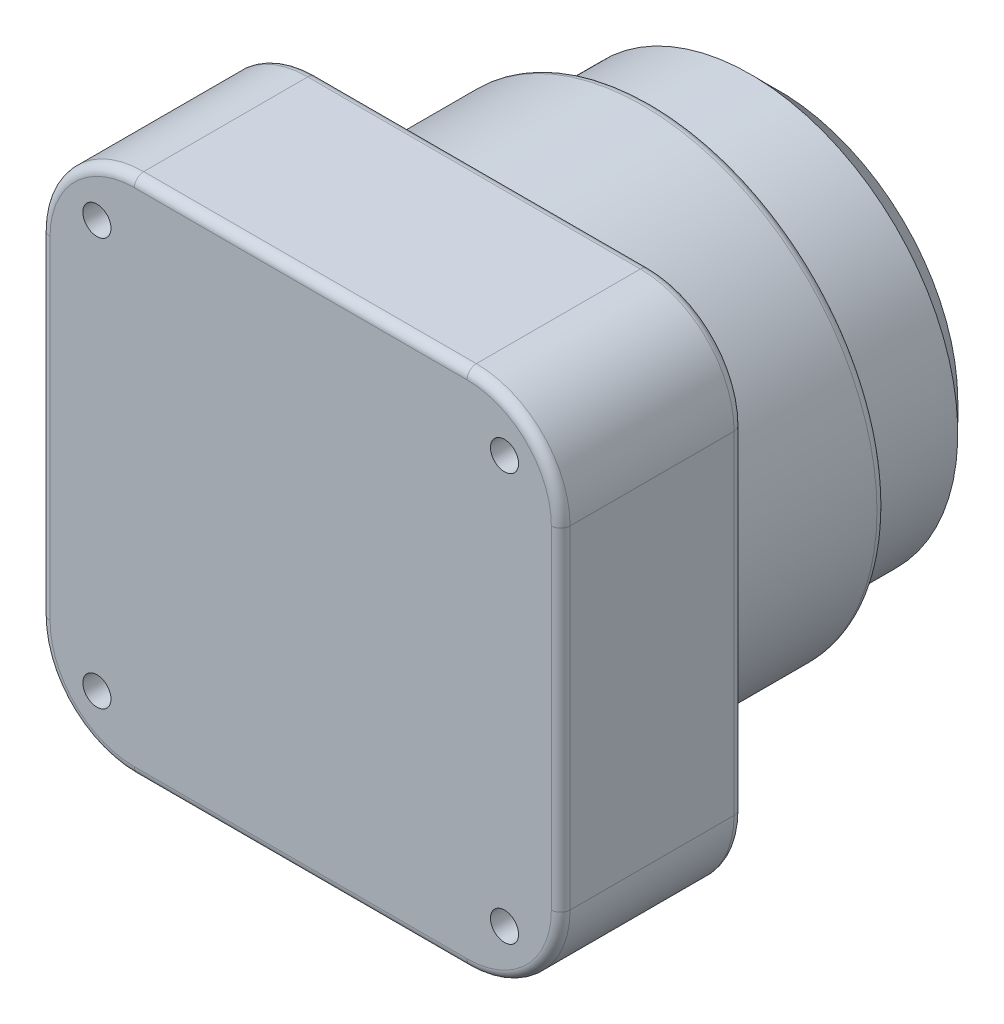
ISO-10303-21;
HEADER;
FILE_DESCRIPTION(('STEP AP214'),'2;1');
FILE_NAME('part.step','',(''),(''),'','','');
FILE_SCHEMA(('AUTOMOTIVE_DESIGN { 1 0 10303 214 1 1 1 1 }'));
ENDSEC;
DATA;
#1=APPLICATION_CONTEXT('core data for automotive mechanical design processes');
#2=APPLICATION_PROTOCOL_DEFINITION('international standard','automotive_design',2000,#1);
#3=PRODUCT_CONTEXT('',#1,'mechanical');
#4=PRODUCT('Part','Part','',(#3));
#5=PRODUCT_RELATED_PRODUCT_CATEGORY('part','',(#4));
#6=PRODUCT_DEFINITION_FORMATION('','',#4);
#7=PRODUCT_DEFINITION_CONTEXT('part definition',#1,'design');
#8=PRODUCT_DEFINITION('design','',#6,#7);
#9=PRODUCT_DEFINITION_SHAPE('','',#8);
#10=(LENGTH_UNIT() NAMED_UNIT(*) SI_UNIT(.MILLI.,.METRE.));
#11=(NAMED_UNIT(*) PLANE_ANGLE_UNIT() SI_UNIT($,.RADIAN.));
#12=(NAMED_UNIT(*) SI_UNIT($,.STERADIAN.) SOLID_ANGLE_UNIT());
#13=UNCERTAINTY_MEASURE_WITH_UNIT(LENGTH_MEASURE(1.E-05),#10,'distance_accuracy_value','');
#14=(GEOMETRIC_REPRESENTATION_CONTEXT(3) GLOBAL_UNCERTAINTY_ASSIGNED_CONTEXT((#13)) GLOBAL_UNIT_ASSIGNED_CONTEXT((#10,
#11,#12)) REPRESENTATION_CONTEXT('',''));
#15=CARTESIAN_POINT('',(0.,0.,0.));
#16=DIRECTION('',(0.,0.,1.));
#17=DIRECTION('',(1.,0.,0.));
#18=AXIS2_PLACEMENT_3D('',#15,#16,#17);
#19=CARTESIAN_POINT('',(0.,0.,19.5));
#20=DIRECTION('',(0.,0.,1.));
#21=DIRECTION('',(1.,0.,0.));
#22=AXIS2_PLACEMENT_3D('',#19,#20,#21);
#23=PLANE('',#22);
#24=CARTESIAN_POINT('',(-21.75,-21.75,19.5));
#25=DIRECTION('',(0.,0.,1.));
#26=DIRECTION('',(1.,0.,0.));
#27=AXIS2_PLACEMENT_3D('',#24,#25,#26);
#28=CIRCLE('',#27,1.5);
#29=CARTESIAN_POINT('',(-20.25,-21.75,19.5));
#30=VERTEX_POINT('',#29);
#31=EDGE_CURVE('E233',#30,#30,#28,.T.);
#32=ORIENTED_EDGE('',*,*,#31,.F.);
#33=EDGE_LOOP('',(#32));
#34=FACE_BOUND('',#33,.T.);
#35=CARTESIAN_POINT('',(21.75,-21.75,19.5));
#36=DIRECTION('',(0.,0.,1.));
#37=DIRECTION('',(1.,0.,0.));
#38=AXIS2_PLACEMENT_3D('',#35,#36,#37);
#39=CIRCLE('',#38,1.5);
#40=CARTESIAN_POINT('',(23.25,-21.75,19.5));
#41=VERTEX_POINT('',#40);
#42=EDGE_CURVE('E227',#41,#41,#39,.T.);
#43=ORIENTED_EDGE('',*,*,#42,.F.);
#44=EDGE_LOOP('',(#43));
#45=FACE_BOUND('',#44,.T.);
#46=CARTESIAN_POINT('',(21.75,21.75,19.5));
#47=DIRECTION('',(0.,0.,1.));
#48=DIRECTION('',(1.,0.,0.));
#49=AXIS2_PLACEMENT_3D('',#46,#47,#48);
#50=CIRCLE('',#49,1.5);
#51=CARTESIAN_POINT('',(23.25,21.75,19.5));
#52=VERTEX_POINT('',#51);
#53=EDGE_CURVE('E220',#52,#52,#50,.T.);
#54=ORIENTED_EDGE('',*,*,#53,.F.);
#55=EDGE_LOOP('',(#54));
#56=FACE_BOUND('',#55,.T.);
#57=CARTESIAN_POINT('',(-21.75,21.75,19.5));
#58=DIRECTION('',(0.,0.,1.));
#59=DIRECTION('',(1.,0.,0.));
#60=AXIS2_PLACEMENT_3D('',#57,#58,#59);
#61=CIRCLE('',#60,1.5);
#62=CARTESIAN_POINT('',(-20.25,21.75,19.5));
#63=VERTEX_POINT('',#62);
#64=EDGE_CURVE('E223',#63,#63,#61,.T.);
#65=ORIENTED_EDGE('',*,*,#64,.F.);
#66=EDGE_LOOP('',(#65));
#67=FACE_BOUND('',#66,.T.);
#68=CARTESIAN_POINT('',(-17.75,17.75,19.5));
#69=DIRECTION('',(0.,0.,1.));
#70=DIRECTION('',(1.,0.,0.));
#71=AXIS2_PLACEMENT_3D('',#68,#69,#70);
#72=CIRCLE('',#71,9.);
#73=CARTESIAN_POINT('',(-26.75,17.75,19.5));
#74=VERTEX_POINT('',#73);
#75=CARTESIAN_POINT('',(-17.75,26.75,19.5));
#76=VERTEX_POINT('',#75);
#77=EDGE_CURVE('E339',#74,#76,#72,.F.);
#78=ORIENTED_EDGE('',*,*,#77,.F.);
#79=DIRECTION('',(0.,-1.,0.));
#80=VECTOR('',#79,1.);
#81=CARTESIAN_POINT('',(-26.75,-27.75,19.5));
#82=LINE('',#81,#80);
#83=CARTESIAN_POINT('',(-26.75,-17.75,19.5));
#84=VERTEX_POINT('',#83);
#85=EDGE_CURVE('E251',#74,#84,#82,.T.);
#86=ORIENTED_EDGE('',*,*,#85,.T.);
#87=CARTESIAN_POINT('',(-17.75,-17.75,19.5));
#88=DIRECTION('',(0.,0.,1.));
#89=DIRECTION('',(1.,0.,0.));
#90=AXIS2_PLACEMENT_3D('',#87,#88,#89);
#91=CIRCLE('',#90,9.);
#92=CARTESIAN_POINT('',(-17.75,-26.75,19.5));
#93=VERTEX_POINT('',#92);
#94=EDGE_CURVE('E330',#93,#84,#91,.F.);
#95=ORIENTED_EDGE('',*,*,#94,.F.);
#96=DIRECTION('',(1.,0.,0.));
#97=VECTOR('',#96,1.);
#98=CARTESIAN_POINT('',(27.75,-26.75,19.5));
#99=LINE('',#98,#97);
#100=CARTESIAN_POINT('',(17.75,-26.75,19.5));
#101=VERTEX_POINT('',#100);
#102=EDGE_CURVE('E254',#93,#101,#99,.T.);
#103=ORIENTED_EDGE('',*,*,#102,.T.);
#104=CARTESIAN_POINT('',(17.75,-17.75,19.5));
#105=DIRECTION('',(0.,0.,1.));
#106=DIRECTION('',(1.,0.,0.));
#107=AXIS2_PLACEMENT_3D('',#104,#105,#106);
#108=CIRCLE('',#107,9.);
#109=CARTESIAN_POINT('',(26.75,-17.75,19.5));
#110=VERTEX_POINT('',#109);
#111=EDGE_CURVE('E333',#110,#101,#108,.F.);
#112=ORIENTED_EDGE('',*,*,#111,.F.);
#113=DIRECTION('',(0.,1.,0.));
#114=VECTOR('',#113,1.);
#115=CARTESIAN_POINT('',(26.75,27.75,19.5));
#116=LINE('',#115,#114);
#117=CARTESIAN_POINT('',(26.75,17.75,19.5));
#118=VERTEX_POINT('',#117);
#119=EDGE_CURVE('E257',#110,#118,#116,.T.);
#120=ORIENTED_EDGE('',*,*,#119,.T.);
#121=CARTESIAN_POINT('',(17.75,17.75,19.5));
#122=DIRECTION('',(0.,0.,1.));
#123=DIRECTION('',(1.,0.,0.));
#124=AXIS2_PLACEMENT_3D('',#121,#122,#123);
#125=CIRCLE('',#124,9.);
#126=CARTESIAN_POINT('',(17.75,26.75,19.5));
#127=VERTEX_POINT('',#126);
#128=EDGE_CURVE('E336',#127,#118,#125,.F.);
#129=ORIENTED_EDGE('',*,*,#128,.F.);
#130=DIRECTION('',(-1.,0.,0.));
#131=VECTOR('',#130,1.);
#132=CARTESIAN_POINT('',(-27.75,26.75,19.5));
#133=LINE('',#132,#131);
#134=EDGE_CURVE('E260',#127,#76,#133,.T.);
#135=ORIENTED_EDGE('',*,*,#134,.T.);
#136=EDGE_LOOP('',(#78,#86,#95,#103,#112,#120,#129,#135));
#137=FACE_BOUND('',#136,.T.);
#138=ADVANCED_FACE('F41',(#34,#45,#56,#67,#137),#23,.T.);
#139=CARTESIAN_POINT('',(0.,0.,0.));
#140=DIRECTION('',(0.,0.,1.));
#141=DIRECTION('',(1.,0.,0.));
#142=AXIS2_PLACEMENT_3D('',#139,#140,#141);
#143=PLANE('',#142);
#144=CARTESIAN_POINT('',(0.,0.,0.));
#145=DIRECTION('',(0.,0.,1.));
#146=DIRECTION('',(1.,0.,0.));
#147=AXIS2_PLACEMENT_3D('',#144,#145,#146);
#148=CIRCLE('',#147,26.);
#149=CARTESIAN_POINT('',(26.,0.,0.));
#150=VERTEX_POINT('',#149);
#151=EDGE_CURVE('E286',#150,#150,#148,.T.);
#152=ORIENTED_EDGE('',*,*,#151,.T.);
#153=EDGE_LOOP('',(#152));
#154=FACE_BOUND('',#153,.T.);
#155=CARTESIAN_POINT('',(-17.75,17.75,0.));
#156=DIRECTION('',(0.,0.,1.));
#157=DIRECTION('',(1.,0.,0.));
#158=AXIS2_PLACEMENT_3D('',#155,#156,#157);
#159=CIRCLE('',#158,9.);
#160=CARTESIAN_POINT('',(-17.75,26.75,0.));
#161=VERTEX_POINT('',#160);
#162=CARTESIAN_POINT('',(-26.75,17.75,0.));
#163=VERTEX_POINT('',#162);
#164=EDGE_CURVE('E323',#161,#163,#159,.T.);
#165=ORIENTED_EDGE('',*,*,#164,.F.);
#166=DIRECTION('',(-1.,0.,0.));
#167=VECTOR('',#166,1.);
#168=CARTESIAN_POINT('',(0.,26.75,0.));
#169=LINE('',#168,#167);
#170=CARTESIAN_POINT('',(17.75,26.75,0.));
#171=VERTEX_POINT('',#170);
#172=EDGE_CURVE('E289',#161,#171,#169,.F.);
#173=ORIENTED_EDGE('',*,*,#172,.T.);
#174=CARTESIAN_POINT('',(17.75,17.75,0.));
#175=DIRECTION('',(0.,0.,1.));
#176=DIRECTION('',(1.,0.,0.));
#177=AXIS2_PLACEMENT_3D('',#174,#175,#176);
#178=CIRCLE('',#177,9.);
#179=CARTESIAN_POINT('',(26.75,17.75,0.));
#180=VERTEX_POINT('',#179);
#181=EDGE_CURVE('E320',#180,#171,#178,.T.);
#182=ORIENTED_EDGE('',*,*,#181,.F.);
#183=DIRECTION('',(0.,1.,0.));
#184=VECTOR('',#183,1.);
#185=CARTESIAN_POINT('',(26.75,0.,0.));
#186=LINE('',#185,#184);
#187=CARTESIAN_POINT('',(26.75,-17.75,0.));
#188=VERTEX_POINT('',#187);
#189=EDGE_CURVE('E292',#180,#188,#186,.F.);
#190=ORIENTED_EDGE('',*,*,#189,.T.);
#191=CARTESIAN_POINT('',(17.75,-17.75,0.));
#192=DIRECTION('',(0.,0.,1.));
#193=DIRECTION('',(1.,0.,0.));
#194=AXIS2_PLACEMENT_3D('',#191,#192,#193);
#195=CIRCLE('',#194,9.);
#196=CARTESIAN_POINT('',(17.75,-26.75,0.));
#197=VERTEX_POINT('',#196);
#198=EDGE_CURVE('E318',#197,#188,#195,.T.);
#199=ORIENTED_EDGE('',*,*,#198,.F.);
#200=DIRECTION('',(1.,0.,0.));
#201=VECTOR('',#200,1.);
#202=CARTESIAN_POINT('',(0.,-26.75,0.));
#203=LINE('',#202,#201);
#204=CARTESIAN_POINT('',(-17.75,-26.75,0.));
#205=VERTEX_POINT('',#204);
#206=EDGE_CURVE('E295',#197,#205,#203,.F.);
#207=ORIENTED_EDGE('',*,*,#206,.T.);
#208=CARTESIAN_POINT('',(-17.75,-17.75,0.));
#209=DIRECTION('',(0.,0.,1.));
#210=DIRECTION('',(1.,0.,0.));
#211=AXIS2_PLACEMENT_3D('',#208,#209,#210);
#212=CIRCLE('',#211,9.);
#213=CARTESIAN_POINT('',(-26.75,-17.75,0.));
#214=VERTEX_POINT('',#213);
#215=EDGE_CURVE('E316',#214,#205,#212,.T.);
#216=ORIENTED_EDGE('',*,*,#215,.F.);
#217=DIRECTION('',(0.,-1.,0.));
#218=VECTOR('',#217,1.);
#219=CARTESIAN_POINT('',(-26.75,0.,0.));
#220=LINE('',#219,#218);
#221=EDGE_CURVE('E298',#214,#163,#220,.F.);
#222=ORIENTED_EDGE('',*,*,#221,.T.);
#223=EDGE_LOOP('',(#165,#173,#182,#190,#199,#207,#216,#222));
#224=FACE_BOUND('',#223,.T.);
#225=ADVANCED_FACE('F442',(#154,#224),#143,.F.);
#226=CARTESIAN_POINT('',(-27.75,-27.75,19.5));
#227=DIRECTION('',(1.,0.,0.));
#228=DIRECTION('',(0.,0.,-1.));
#229=AXIS2_PLACEMENT_3D('',#226,#227,#228);
#230=PLANE('',#229);
#231=DIRECTION('',(0.,-1.,0.));
#232=VECTOR('',#231,1.);
#233=CARTESIAN_POINT('',(-27.75,-27.75,1.));
#234=LINE('',#233,#232);
#235=CARTESIAN_POINT('',(-27.75,17.75,1.));
#236=VERTEX_POINT('',#235);
#237=CARTESIAN_POINT('',(-27.75,-17.75,1.));
#238=VERTEX_POINT('',#237);
#239=EDGE_CURVE('E281',#236,#238,#234,.T.);
#240=ORIENTED_EDGE('',*,*,#239,.T.);
#241=DIRECTION('',(0.,0.,-1.));
#242=VECTOR('',#241,1.);
#243=CARTESIAN_POINT('',(-27.75,-17.75,19.5));
#244=LINE('',#243,#242);
#245=CARTESIAN_POINT('',(-27.75,-17.75,18.5));
#246=VERTEX_POINT('',#245);
#247=EDGE_CURVE('E377',#238,#246,#244,.F.);
#248=ORIENTED_EDGE('',*,*,#247,.T.);
#249=DIRECTION('',(0.,-1.,0.));
#250=VECTOR('',#249,1.);
#251=CARTESIAN_POINT('',(-27.75,27.75,18.5));
#252=LINE('',#251,#250);
#253=CARTESIAN_POINT('',(-27.75,17.75,18.5));
#254=VERTEX_POINT('',#253);
#255=EDGE_CURVE('E284',#246,#254,#252,.F.);
#256=ORIENTED_EDGE('',*,*,#255,.T.);
#257=DIRECTION('',(0.,0.,-1.));
#258=VECTOR('',#257,1.);
#259=CARTESIAN_POINT('',(-27.75,17.75,19.5));
#260=LINE('',#259,#258);
#261=EDGE_CURVE('E375',#254,#236,#260,.T.);
#262=ORIENTED_EDGE('',*,*,#261,.T.);
#263=EDGE_LOOP('',(#240,#248,#256,#262));
#264=FACE_BOUND('',#263,.T.);
#265=ADVANCED_FACE('F430',(#264),#230,.F.);
#266=CARTESIAN_POINT('',(27.75,-27.75,19.5));
#267=DIRECTION('',(0.,1.,0.));
#268=DIRECTION('',(-1.,0.,0.));
#269=AXIS2_PLACEMENT_3D('',#266,#267,#268);
#270=PLANE('',#269);
#271=DIRECTION('',(1.,0.,0.));
#272=VECTOR('',#271,1.);
#273=CARTESIAN_POINT('',(7.25,-27.75,14.));
#274=LINE('',#273,#272);
#275=CARTESIAN_POINT('',(-7.25000000000001,-27.75,14.));
#276=VERTEX_POINT('',#275);
#277=CARTESIAN_POINT('',(7.25,-27.75,14.));
#278=VERTEX_POINT('',#277);
#279=EDGE_CURVE('E210',#276,#278,#274,.T.);
#280=ORIENTED_EDGE('',*,*,#279,.F.);
#281=DIRECTION('',(0.,0.,-1.));
#282=VECTOR('',#281,1.);
#283=CARTESIAN_POINT('',(-7.25,-27.75,16.5));
#284=LINE('',#283,#282);
#285=CARTESIAN_POINT('',(-7.25,-27.75,16.5));
#286=VERTEX_POINT('',#285);
#287=EDGE_CURVE('E58',#286,#276,#284,.T.);
#288=ORIENTED_EDGE('',*,*,#287,.F.);
#289=DIRECTION('',(-1.,0.,0.));
#290=VECTOR('',#289,1.);
#291=CARTESIAN_POINT('',(7.25,-27.75,16.5));
#292=LINE('',#291,#290);
#293=CARTESIAN_POINT('',(7.25,-27.75,16.5));
#294=VERTEX_POINT('',#293);
#295=EDGE_CURVE('E201',#294,#286,#292,.T.);
#296=ORIENTED_EDGE('',*,*,#295,.F.);
#297=DIRECTION('',(0.,0.,1.));
#298=VECTOR('',#297,1.);
#299=CARTESIAN_POINT('',(7.25,-27.75,16.5));
#300=LINE('',#299,#298);
#301=EDGE_CURVE('E204',#278,#294,#300,.T.);
#302=ORIENTED_EDGE('',*,*,#301,.F.);
#303=EDGE_LOOP('',(#280,#288,#296,#302));
#304=FACE_BOUND('',#303,.T.);
#305=DIRECTION('',(1.,0.,0.));
#306=VECTOR('',#305,1.);
#307=CARTESIAN_POINT('',(-27.75,-27.75,18.5));
#308=LINE('',#307,#306);
#309=CARTESIAN_POINT('',(17.75,-27.75,18.5));
#310=VERTEX_POINT('',#309);
#311=CARTESIAN_POINT('',(-17.75,-27.75,18.5));
#312=VERTEX_POINT('',#311);
#313=EDGE_CURVE('E278',#310,#312,#308,.F.);
#314=ORIENTED_EDGE('',*,*,#313,.T.);
#315=DIRECTION('',(0.,0.,-1.));
#316=VECTOR('',#315,1.);
#317=CARTESIAN_POINT('',(-17.75,-27.75,19.5));
#318=LINE('',#317,#316);
#319=CARTESIAN_POINT('',(-17.75,-27.75,1.));
#320=VERTEX_POINT('',#319);
#321=EDGE_CURVE('E373',#312,#320,#318,.T.);
#322=ORIENTED_EDGE('',*,*,#321,.T.);
#323=DIRECTION('',(1.,0.,0.));
#324=VECTOR('',#323,1.);
#325=CARTESIAN_POINT('',(27.75,-27.75,1.));
#326=LINE('',#325,#324);
#327=CARTESIAN_POINT('',(17.75,-27.75,1.));
#328=VERTEX_POINT('',#327);
#329=EDGE_CURVE('E275',#320,#328,#326,.T.);
#330=ORIENTED_EDGE('',*,*,#329,.T.);
#331=DIRECTION('',(0.,0.,-1.));
#332=VECTOR('',#331,1.);
#333=CARTESIAN_POINT('',(17.75,-27.75,19.5));
#334=LINE('',#333,#332);
#335=EDGE_CURVE('E371',#328,#310,#334,.F.);
#336=ORIENTED_EDGE('',*,*,#335,.T.);
#337=EDGE_LOOP('',(#314,#322,#330,#336));
#338=FACE_BOUND('',#337,.T.);
#339=ADVANCED_FACE('F461',(#304,#338),#270,.F.);
#340=CARTESIAN_POINT('',(27.75,-27.75,19.5));
#341=DIRECTION('',(-1.,0.,0.));
#342=DIRECTION('',(0.,0.,1.));
#343=AXIS2_PLACEMENT_3D('',#340,#341,#342);
#344=PLANE('',#343);
#345=DIRECTION('',(0.,1.,0.));
#346=VECTOR('',#345,1.);
#347=CARTESIAN_POINT('',(27.75,-27.75,18.5));
#348=LINE('',#347,#346);
#349=CARTESIAN_POINT('',(27.75,17.75,18.5));
#350=VERTEX_POINT('',#349);
#351=CARTESIAN_POINT('',(27.75,-17.75,18.5));
#352=VERTEX_POINT('',#351);
#353=EDGE_CURVE('E272',#350,#352,#348,.F.);
#354=ORIENTED_EDGE('',*,*,#353,.T.);
#355=DIRECTION('',(0.,0.,-1.));
#356=VECTOR('',#355,1.);
#357=CARTESIAN_POINT('',(27.75,-17.75,19.5));
#358=LINE('',#357,#356);
#359=CARTESIAN_POINT('',(27.75,-17.75,1.));
#360=VERTEX_POINT('',#359);
#361=EDGE_CURVE('E381',#352,#360,#358,.T.);
#362=ORIENTED_EDGE('',*,*,#361,.T.);
#363=DIRECTION('',(0.,1.,0.));
#364=VECTOR('',#363,1.);
#365=CARTESIAN_POINT('',(27.75,-27.75,1.));
#366=LINE('',#365,#364);
#367=CARTESIAN_POINT('',(27.75,17.75,1.));
#368=VERTEX_POINT('',#367);
#369=EDGE_CURVE('E269',#360,#368,#366,.T.);
#370=ORIENTED_EDGE('',*,*,#369,.T.);
#371=DIRECTION('',(0.,0.,-1.));
#372=VECTOR('',#371,1.);
#373=CARTESIAN_POINT('',(27.75,17.75,19.5));
#374=LINE('',#373,#372);
#375=EDGE_CURVE('E379',#368,#350,#374,.F.);
#376=ORIENTED_EDGE('',*,*,#375,.T.);
#377=EDGE_LOOP('',(#354,#362,#370,#376));
#378=FACE_BOUND('',#377,.T.);
#379=ADVANCED_FACE('F518',(#378),#344,.F.);
#380=CARTESIAN_POINT('',(27.75,27.75,19.5));
#381=DIRECTION('',(0.,-1.,0.));
#382=DIRECTION('',(1.,0.,0.));
#383=AXIS2_PLACEMENT_3D('',#380,#381,#382);
#384=PLANE('',#383);
#385=DIRECTION('',(-1.,0.,0.));
#386=VECTOR('',#385,1.);
#387=CARTESIAN_POINT('',(27.75,27.75,18.5));
#388=LINE('',#387,#386);
#389=CARTESIAN_POINT('',(-17.75,27.75,18.5));
#390=VERTEX_POINT('',#389);
#391=CARTESIAN_POINT('',(17.75,27.75,18.5));
#392=VERTEX_POINT('',#391);
#393=EDGE_CURVE('E266',#390,#392,#388,.F.);
#394=ORIENTED_EDGE('',*,*,#393,.T.);
#395=DIRECTION('',(0.,0.,-1.));
#396=VECTOR('',#395,1.);
#397=CARTESIAN_POINT('',(17.75,27.75,19.5));
#398=LINE('',#397,#396);
#399=CARTESIAN_POINT('',(17.75,27.75,1.));
#400=VERTEX_POINT('',#399);
#401=EDGE_CURVE('E11',#392,#400,#398,.T.);
#402=ORIENTED_EDGE('',*,*,#401,.T.);
#403=DIRECTION('',(-1.,0.,0.));
#404=VECTOR('',#403,1.);
#405=CARTESIAN_POINT('',(27.75,27.75,1.));
#406=LINE('',#405,#404);
#407=CARTESIAN_POINT('',(-17.75,27.75,1.));
#408=VERTEX_POINT('',#407);
#409=EDGE_CURVE('E263',#400,#408,#406,.T.);
#410=ORIENTED_EDGE('',*,*,#409,.T.);
#411=DIRECTION('',(0.,0.,-1.));
#412=VECTOR('',#411,1.);
#413=CARTESIAN_POINT('',(-17.75,27.75,19.5));
#414=LINE('',#413,#412);
#415=EDGE_CURVE('E50',#408,#390,#414,.F.);
#416=ORIENTED_EDGE('',*,*,#415,.T.);
#417=EDGE_LOOP('',(#394,#402,#410,#416));
#418=FACE_BOUND('',#417,.T.);
#419=ADVANCED_FACE('F484',(#418),#384,.F.);
#420=CARTESIAN_POINT('',(0.,0.,-18.));
#421=DIRECTION('',(0.,0.,1.));
#422=DIRECTION('',(1.,0.,0.));
#423=AXIS2_PLACEMENT_3D('',#420,#421,#422);
#424=CYLINDRICAL_SURFACE('',#423,25.);
#425=CARTESIAN_POINT('',(0.,0.,-1.));
#426=DIRECTION('',(0.,0.,1.));
#427=DIRECTION('',(1.,0.,0.));
#428=AXIS2_PLACEMENT_3D('',#425,#426,#427);
#429=CIRCLE('',#428,25.);
#430=CARTESIAN_POINT('',(25.,0.,-1.));
#431=VERTEX_POINT('',#430);
#432=EDGE_CURVE('E304',#431,#431,#429,.F.);
#433=ORIENTED_EDGE('',*,*,#432,.T.);
#434=EDGE_LOOP('',(#433));
#435=FACE_BOUND('',#434,.T.);
#436=CARTESIAN_POINT('',(0.,0.,-17.));
#437=DIRECTION('',(0.,0.,-1.));
#438=DIRECTION('',(-1.,0.,0.));
#439=AXIS2_PLACEMENT_3D('',#436,#437,#438);
#440=CIRCLE('',#439,25.);
#441=CARTESIAN_POINT('',(-25.,0.,-17.));
#442=VERTEX_POINT('',#441);
#443=EDGE_CURVE('E301',#442,#442,#440,.F.);
#444=ORIENTED_EDGE('',*,*,#443,.T.);
#445=EDGE_LOOP('',(#444));
#446=FACE_BOUND('',#445,.T.);
#447=ADVANCED_FACE('F513',(#435,#446),#424,.T.);
#448=CARTESIAN_POINT('',(0.,0.,-18.));
#449=DIRECTION('',(0.,0.,-1.));
#450=DIRECTION('',(-1.,0.,0.));
#451=AXIS2_PLACEMENT_3D('',#448,#449,#450);
#452=PLANE('',#451);
#453=CARTESIAN_POINT('',(0.,0.,-18.));
#454=DIRECTION('',(0.,0.,-1.));
#455=DIRECTION('',(-1.,0.,0.));
#456=AXIS2_PLACEMENT_3D('',#453,#454,#455);
#457=CIRCLE('',#456,24.);
#458=CARTESIAN_POINT('',(-24.,0.,-18.));
#459=VERTEX_POINT('',#458);
#460=EDGE_CURVE('E310',#459,#459,#457,.T.);
#461=ORIENTED_EDGE('',*,*,#460,.T.);
#462=EDGE_LOOP('',(#461));
#463=FACE_BOUND('',#462,.T.);
#464=CARTESIAN_POINT('',(0.,0.,-18.));
#465=DIRECTION('',(0.,0.,-1.));
#466=DIRECTION('',(-1.,0.,0.));
#467=AXIS2_PLACEMENT_3D('',#464,#465,#466);
#468=CIRCLE('',#467,23.125);
#469=CARTESIAN_POINT('',(-23.125,0.,-18.));
#470=VERTEX_POINT('',#469);
#471=EDGE_CURVE('E307',#470,#470,#468,.F.);
#472=ORIENTED_EDGE('',*,*,#471,.T.);
#473=EDGE_LOOP('',(#472));
#474=FACE_BOUND('',#473,.T.);
#475=ADVANCED_FACE('F947',(#463,#474),#452,.T.);
#476=CARTESIAN_POINT('',(0.,0.,-31.5));
#477=DIRECTION('',(0.,0.,1.));
#478=DIRECTION('',(1.,0.,0.));
#479=AXIS2_PLACEMENT_3D('',#476,#477,#478);
#480=CYLINDRICAL_SURFACE('',#479,22.125);
#481=CARTESIAN_POINT('',(0.,0.,-19.));
#482=DIRECTION('',(0.,0.,-1.));
#483=DIRECTION('',(-1.,0.,0.));
#484=AXIS2_PLACEMENT_3D('',#481,#482,#483);
#485=CIRCLE('',#484,22.125);
#486=CARTESIAN_POINT('',(-22.125,0.,-19.));
#487=VERTEX_POINT('',#486);
#488=EDGE_CURVE('E313',#487,#487,#485,.T.);
#489=ORIENTED_EDGE('',*,*,#488,.T.);
#490=EDGE_LOOP('',(#489));
#491=FACE_BOUND('',#490,.T.);
#492=CARTESIAN_POINT('',(0.,0.,-28.5));
#493=DIRECTION('',(0.,0.,-1.));
#494=DIRECTION('',(-1.,0.,0.));
#495=AXIS2_PLACEMENT_3D('',#492,#493,#494);
#496=CIRCLE('',#495,22.125);
#497=CARTESIAN_POINT('',(-22.125,0.,-28.5));
#498=VERTEX_POINT('',#497);
#499=EDGE_CURVE('E247',#498,#498,#496,.F.);
#500=ORIENTED_EDGE('',*,*,#499,.T.);
#501=EDGE_LOOP('',(#500));
#502=FACE_BOUND('',#501,.T.);
#503=ADVANCED_FACE('F937',(#491,#502),#480,.T.);
#504=CARTESIAN_POINT('',(0.,0.,-31.5));
#505=DIRECTION('',(0.,0.,-1.));
#506=DIRECTION('',(-1.,0.,0.));
#507=AXIS2_PLACEMENT_3D('',#504,#505,#506);
#508=PLANE('',#507);
#509=CARTESIAN_POINT('',(0.,0.,-31.5));
#510=DIRECTION('',(0.,0.,-1.));
#511=DIRECTION('',(-1.,0.,0.));
#512=AXIS2_PLACEMENT_3D('',#509,#510,#511);
#513=CIRCLE('',#512,19.125);
#514=CARTESIAN_POINT('',(-19.125,0.,-31.5));
#515=VERTEX_POINT('',#514);
#516=EDGE_CURVE('E244',#515,#515,#513,.T.);
#517=ORIENTED_EDGE('',*,*,#516,.T.);
#518=EDGE_LOOP('',(#517));
#519=FACE_BOUND('',#518,.T.);
#520=ADVANCED_FACE('F532',(#519),#508,.T.);
#521=CARTESIAN_POINT('',(0.,0.,-31.5));
#522=DIRECTION('',(0.,0.,1.));
#523=DIRECTION('',(1.,0.,0.));
#524=AXIS2_PLACEMENT_3D('',#521,#522,#523);
#525=CONICAL_SURFACE('',#524,19.125,0.785398163397447);
#526=ORIENTED_EDGE('',*,*,#499,.F.);
#527=EDGE_LOOP('',(#526));
#528=FACE_BOUND('',#527,.T.);
#529=ORIENTED_EDGE('',*,*,#516,.F.);
#530=EDGE_LOOP('',(#529));
#531=FACE_BOUND('',#530,.T.);
#532=ADVANCED_FACE('F527',(#528,#531),#525,.T.);
#533=CARTESIAN_POINT('',(0.,-26.75,18.5));
#534=DIRECTION('',(-1.,0.,0.));
#535=DIRECTION('',(0.,-1.,0.));
#536=AXIS2_PLACEMENT_3D('',#533,#534,#535);
#537=CYLINDRICAL_SURFACE('',#536,1.);
#538=ORIENTED_EDGE('',*,*,#313,.F.);
#539=CARTESIAN_POINT('',(17.75,-26.75,18.5));
#540=DIRECTION('',(-1.,0.,0.));
#541=DIRECTION('',(0.,0.,1.));
#542=AXIS2_PLACEMENT_3D('',#539,#540,#541);
#543=CIRCLE('',#542,1.);
#544=EDGE_CURVE('E361',#310,#101,#543,.T.);
#545=ORIENTED_EDGE('',*,*,#544,.T.);
#546=ORIENTED_EDGE('',*,*,#102,.F.);
#547=CARTESIAN_POINT('',(-17.75,-26.75,18.5));
#548=DIRECTION('',(1.,0.,0.));
#549=DIRECTION('',(0.,0.,-1.));
#550=AXIS2_PLACEMENT_3D('',#547,#548,#549);
#551=CIRCLE('',#550,1.);
#552=EDGE_CURVE('E359',#93,#312,#551,.T.);
#553=ORIENTED_EDGE('',*,*,#552,.T.);
#554=EDGE_LOOP('',(#538,#545,#546,#553));
#555=FACE_BOUND('',#554,.T.);
#556=ADVANCED_FACE('F464',(#555),#537,.T.);
#557=CARTESIAN_POINT('',(26.75,0.,18.5));
#558=DIRECTION('',(0.,-1.,0.));
#559=DIRECTION('',(0.,0.,-1.));
#560=AXIS2_PLACEMENT_3D('',#557,#558,#559);
#561=CYLINDRICAL_SURFACE('',#560,1.);
#562=ORIENTED_EDGE('',*,*,#353,.F.);
#563=CARTESIAN_POINT('',(26.75,17.75,18.5));
#564=DIRECTION('',(0.,-1.,0.));
#565=DIRECTION('',(0.,0.,-1.));
#566=AXIS2_PLACEMENT_3D('',#563,#564,#565);
#567=CIRCLE('',#566,1.);
#568=EDGE_CURVE('E352',#350,#118,#567,.T.);
#569=ORIENTED_EDGE('',*,*,#568,.T.);
#570=ORIENTED_EDGE('',*,*,#119,.F.);
#571=CARTESIAN_POINT('',(26.75,-17.75,18.5));
#572=DIRECTION('',(0.,1.,0.));
#573=DIRECTION('',(0.,0.,1.));
#574=AXIS2_PLACEMENT_3D('',#571,#572,#573);
#575=CIRCLE('',#574,1.);
#576=EDGE_CURVE('E350',#110,#352,#575,.T.);
#577=ORIENTED_EDGE('',*,*,#576,.T.);
#578=EDGE_LOOP('',(#562,#569,#570,#577));
#579=FACE_BOUND('',#578,.T.);
#580=ADVANCED_FACE('F471',(#579),#561,.T.);
#581=CARTESIAN_POINT('',(-26.75,0.,18.5));
#582=DIRECTION('',(0.,1.,0.));
#583=DIRECTION('',(0.,0.,1.));
#584=AXIS2_PLACEMENT_3D('',#581,#582,#583);
#585=CYLINDRICAL_SURFACE('',#584,1.);
#586=ORIENTED_EDGE('',*,*,#255,.F.);
#587=CARTESIAN_POINT('',(-26.75,-17.75,18.5));
#588=DIRECTION('',(0.,1.,0.));
#589=DIRECTION('',(0.,0.,1.));
#590=AXIS2_PLACEMENT_3D('',#587,#588,#589);
#591=CIRCLE('',#590,1.);
#592=EDGE_CURVE('E369',#246,#84,#591,.T.);
#593=ORIENTED_EDGE('',*,*,#592,.T.);
#594=ORIENTED_EDGE('',*,*,#85,.F.);
#595=CARTESIAN_POINT('',(-26.75,17.75,18.5));
#596=DIRECTION('',(0.,-1.,0.));
#597=DIRECTION('',(0.,0.,-1.));
#598=AXIS2_PLACEMENT_3D('',#595,#596,#597);
#599=CIRCLE('',#598,1.);
#600=EDGE_CURVE('E66',#74,#254,#599,.T.);
#601=ORIENTED_EDGE('',*,*,#600,.T.);
#602=EDGE_LOOP('',(#586,#593,#594,#601));
#603=FACE_BOUND('',#602,.T.);
#604=ADVANCED_FACE('F414',(#603),#585,.T.);
#605=CARTESIAN_POINT('',(0.,26.75,18.5));
#606=DIRECTION('',(1.,0.,0.));
#607=DIRECTION('',(0.,1.,0.));
#608=AXIS2_PLACEMENT_3D('',#605,#606,#607);
#609=CYLINDRICAL_SURFACE('',#608,1.);
#610=ORIENTED_EDGE('',*,*,#393,.F.);
#611=CARTESIAN_POINT('',(-17.75,26.75,18.5));
#612=DIRECTION('',(1.,0.,0.));
#613=DIRECTION('',(0.,0.,-1.));
#614=AXIS2_PLACEMENT_3D('',#611,#612,#613);
#615=CIRCLE('',#614,1.);
#616=EDGE_CURVE('E344',#390,#76,#615,.T.);
#617=ORIENTED_EDGE('',*,*,#616,.T.);
#618=ORIENTED_EDGE('',*,*,#134,.F.);
#619=CARTESIAN_POINT('',(17.75,26.75,18.5));
#620=DIRECTION('',(-1.,0.,0.));
#621=DIRECTION('',(0.,0.,1.));
#622=AXIS2_PLACEMENT_3D('',#619,#620,#621);
#623=CIRCLE('',#622,1.);
#624=EDGE_CURVE('E342',#127,#392,#623,.T.);
#625=ORIENTED_EDGE('',*,*,#624,.T.);
#626=EDGE_LOOP('',(#610,#617,#618,#625));
#627=FACE_BOUND('',#626,.T.);
#628=ADVANCED_FACE('F534',(#627),#609,.T.);
#629=CARTESIAN_POINT('',(26.75,-27.75,1.));
#630=DIRECTION('',(0.,1.,0.));
#631=DIRECTION('',(0.,0.,1.));
#632=AXIS2_PLACEMENT_3D('',#629,#630,#631);
#633=CYLINDRICAL_SURFACE('',#632,1.);
#634=ORIENTED_EDGE('',*,*,#369,.F.);
#635=CARTESIAN_POINT('',(26.75,-17.75,1.));
#636=DIRECTION('',(0.,1.,0.));
#637=DIRECTION('',(0.,0.,1.));
#638=AXIS2_PLACEMENT_3D('',#635,#636,#637);
#639=CIRCLE('',#638,1.);
#640=EDGE_CURVE('E356',#360,#188,#639,.T.);
#641=ORIENTED_EDGE('',*,*,#640,.T.);
#642=ORIENTED_EDGE('',*,*,#189,.F.);
#643=CARTESIAN_POINT('',(26.75,17.75,1.));
#644=DIRECTION('',(0.,-1.,0.));
#645=DIRECTION('',(0.,0.,-1.));
#646=AXIS2_PLACEMENT_3D('',#643,#644,#645);
#647=CIRCLE('',#646,1.);
#648=EDGE_CURVE('E354',#180,#368,#647,.T.);
#649=ORIENTED_EDGE('',*,*,#648,.T.);
#650=EDGE_LOOP('',(#634,#641,#642,#649));
#651=FACE_BOUND('',#650,.T.);
#652=ADVANCED_FACE('F450',(#651),#633,.T.);
#653=CARTESIAN_POINT('',(27.75,26.75,1.));
#654=DIRECTION('',(-1.,0.,0.));
#655=DIRECTION('',(0.,-1.,0.));
#656=AXIS2_PLACEMENT_3D('',#653,#654,#655);
#657=CYLINDRICAL_SURFACE('',#656,1.);
#658=ORIENTED_EDGE('',*,*,#409,.F.);
#659=CARTESIAN_POINT('',(17.75,26.75,1.));
#660=DIRECTION('',(-1.,0.,0.));
#661=DIRECTION('',(0.,0.,1.));
#662=AXIS2_PLACEMENT_3D('',#659,#660,#661);
#663=CIRCLE('',#662,1.);
#664=EDGE_CURVE('E348',#400,#171,#663,.T.);
#665=ORIENTED_EDGE('',*,*,#664,.T.);
#666=ORIENTED_EDGE('',*,*,#172,.F.);
#667=CARTESIAN_POINT('',(-17.75,26.75,1.));
#668=DIRECTION('',(1.,0.,0.));
#669=DIRECTION('',(0.,0.,-1.));
#670=AXIS2_PLACEMENT_3D('',#667,#668,#669);
#671=CIRCLE('',#670,1.);
#672=EDGE_CURVE('E346',#161,#408,#671,.T.);
#673=ORIENTED_EDGE('',*,*,#672,.T.);
#674=EDGE_LOOP('',(#658,#665,#666,#673));
#675=FACE_BOUND('',#674,.T.);
#676=ADVANCED_FACE('F487',(#675),#657,.T.);
#677=CARTESIAN_POINT('',(27.75,-26.75,1.));
#678=DIRECTION('',(1.,0.,0.));
#679=DIRECTION('',(0.,1.,0.));
#680=AXIS2_PLACEMENT_3D('',#677,#678,#679);
#681=CYLINDRICAL_SURFACE('',#680,1.);
#682=ORIENTED_EDGE('',*,*,#329,.F.);
#683=CARTESIAN_POINT('',(-17.75,-26.75,1.));
#684=DIRECTION('',(1.,0.,0.));
#685=DIRECTION('',(0.,0.,-1.));
#686=AXIS2_PLACEMENT_3D('',#683,#684,#685);
#687=CIRCLE('',#686,1.);
#688=EDGE_CURVE('E365',#320,#205,#687,.T.);
#689=ORIENTED_EDGE('',*,*,#688,.T.);
#690=ORIENTED_EDGE('',*,*,#206,.F.);
#691=CARTESIAN_POINT('',(17.75,-26.75,1.));
#692=DIRECTION('',(-1.,0.,0.));
#693=DIRECTION('',(0.,0.,1.));
#694=AXIS2_PLACEMENT_3D('',#691,#692,#693);
#695=CIRCLE('',#694,1.);
#696=EDGE_CURVE('E363',#197,#328,#695,.T.);
#697=ORIENTED_EDGE('',*,*,#696,.T.);
#698=EDGE_LOOP('',(#682,#689,#690,#697));
#699=FACE_BOUND('',#698,.T.);
#700=ADVANCED_FACE('F439',(#699),#681,.T.);
#701=CARTESIAN_POINT('',(-26.75,-27.75,1.));
#702=DIRECTION('',(0.,-1.,0.));
#703=DIRECTION('',(0.,0.,-1.));
#704=AXIS2_PLACEMENT_3D('',#701,#702,#703);
#705=CYLINDRICAL_SURFACE('',#704,1.);
#706=ORIENTED_EDGE('',*,*,#239,.F.);
#707=CARTESIAN_POINT('',(-26.75,17.75,1.));
#708=DIRECTION('',(0.,-1.,0.));
#709=DIRECTION('',(0.,0.,-1.));
#710=AXIS2_PLACEMENT_3D('',#707,#708,#709);
#711=CIRCLE('',#710,1.);
#712=EDGE_CURVE('E328',#236,#163,#711,.T.);
#713=ORIENTED_EDGE('',*,*,#712,.T.);
#714=ORIENTED_EDGE('',*,*,#221,.F.);
#715=CARTESIAN_POINT('',(-26.75,-17.75,1.));
#716=DIRECTION('',(0.,1.,0.));
#717=DIRECTION('',(0.,0.,1.));
#718=AXIS2_PLACEMENT_3D('',#715,#716,#717);
#719=CIRCLE('',#718,1.);
#720=EDGE_CURVE('E326',#214,#238,#719,.T.);
#721=ORIENTED_EDGE('',*,*,#720,.T.);
#722=EDGE_LOOP('',(#706,#713,#714,#721));
#723=FACE_BOUND('',#722,.T.);
#724=ADVANCED_FACE('F432',(#723),#705,.T.);
#725=CARTESIAN_POINT('',(0.,0.,-1.));
#726=DIRECTION('',(0.,0.,1.));
#727=DIRECTION('',(1.,0.,0.));
#728=AXIS2_PLACEMENT_3D('',#725,#726,#727);
#729=TOROIDAL_SURFACE('',#728,26.,1.);
#730=ORIENTED_EDGE('',*,*,#151,.F.);
#731=EDGE_LOOP('',(#730));
#732=FACE_BOUND('',#731,.T.);
#733=ORIENTED_EDGE('',*,*,#432,.F.);
#734=EDGE_LOOP('',(#733));
#735=FACE_BOUND('',#734,.T.);
#736=ADVANCED_FACE('F546',(#732,#735),#729,.F.);
#737=CARTESIAN_POINT('',(0.,0.,-17.));
#738=DIRECTION('',(0.,0.,-1.));
#739=DIRECTION('',(-1.,0.,0.));
#740=AXIS2_PLACEMENT_3D('',#737,#738,#739);
#741=TOROIDAL_SURFACE('',#740,24.,1.);
#742=ORIENTED_EDGE('',*,*,#443,.F.);
#743=EDGE_LOOP('',(#742));
#744=FACE_BOUND('',#743,.T.);
#745=ORIENTED_EDGE('',*,*,#460,.F.);
#746=EDGE_LOOP('',(#745));
#747=FACE_BOUND('',#746,.T.);
#748=ADVANCED_FACE('F555',(#744,#747),#741,.T.);
#749=CARTESIAN_POINT('',(0.,0.,-19.));
#750=DIRECTION('',(0.,0.,-1.));
#751=DIRECTION('',(-1.,0.,0.));
#752=AXIS2_PLACEMENT_3D('',#749,#750,#751);
#753=TOROIDAL_SURFACE('',#752,23.125,1.);
#754=ORIENTED_EDGE('',*,*,#471,.F.);
#755=EDGE_LOOP('',(#754));
#756=FACE_BOUND('',#755,.T.);
#757=ORIENTED_EDGE('',*,*,#488,.F.);
#758=EDGE_LOOP('',(#757));
#759=FACE_BOUND('',#758,.T.);
#760=ADVANCED_FACE('F559',(#756,#759),#753,.F.);
#761=CARTESIAN_POINT('',(-17.75,17.75,18.5));
#762=DIRECTION('',(0.,0.,1.));
#763=DIRECTION('',(1.,0.,0.));
#764=AXIS2_PLACEMENT_3D('',#761,#762,#763);
#765=TOROIDAL_SURFACE('',#764,9.,1.);
#766=ORIENTED_EDGE('',*,*,#77,.T.);
#767=ORIENTED_EDGE('',*,*,#616,.F.);
#768=CARTESIAN_POINT('',(-17.75,17.75,18.5));
#769=DIRECTION('',(0.,0.,1.));
#770=DIRECTION('',(1.,0.,0.));
#771=AXIS2_PLACEMENT_3D('',#768,#769,#770);
#772=CIRCLE('',#771,10.);
#773=EDGE_CURVE('E248',#254,#390,#772,.F.);
#774=ORIENTED_EDGE('',*,*,#773,.F.);
#775=ORIENTED_EDGE('',*,*,#600,.F.);
#776=EDGE_LOOP('',(#766,#767,#774,#775));
#777=FACE_BOUND('',#776,.T.);
#778=ADVANCED_FACE('F420',(#777),#765,.T.);
#779=CARTESIAN_POINT('',(-17.75,17.75,19.5));
#780=DIRECTION('',(0.,0.,-1.));
#781=DIRECTION('',(-1.,0.,0.));
#782=AXIS2_PLACEMENT_3D('',#779,#780,#781);
#783=CYLINDRICAL_SURFACE('',#782,10.);
#784=ORIENTED_EDGE('',*,*,#773,.T.);
#785=ORIENTED_EDGE('',*,*,#415,.F.);
#786=CARTESIAN_POINT('',(-17.75,17.75,1.));
#787=DIRECTION('',(0.,0.,1.));
#788=DIRECTION('',(1.,0.,0.));
#789=AXIS2_PLACEMENT_3D('',#786,#787,#788);
#790=CIRCLE('',#789,10.);
#791=EDGE_CURVE('E384',#236,#408,#790,.F.);
#792=ORIENTED_EDGE('',*,*,#791,.F.);
#793=ORIENTED_EDGE('',*,*,#261,.F.);
#794=EDGE_LOOP('',(#784,#785,#792,#793));
#795=FACE_BOUND('',#794,.T.);
#796=ADVANCED_FACE('F426',(#795),#783,.T.);
#797=CARTESIAN_POINT('',(-17.75,17.75,1.));
#798=DIRECTION('',(0.,0.,1.));
#799=DIRECTION('',(1.,0.,0.));
#800=AXIS2_PLACEMENT_3D('',#797,#798,#799);
#801=TOROIDAL_SURFACE('',#800,9.,1.);
#802=ORIENTED_EDGE('',*,*,#672,.F.);
#803=ORIENTED_EDGE('',*,*,#164,.T.);
#804=ORIENTED_EDGE('',*,*,#712,.F.);
#805=ORIENTED_EDGE('',*,*,#791,.T.);
#806=EDGE_LOOP('',(#802,#803,#804,#805));
#807=FACE_BOUND('',#806,.T.);
#808=ADVANCED_FACE('F490',(#807),#801,.T.);
#809=CARTESIAN_POINT('',(17.75,17.75,18.5));
#810=DIRECTION('',(0.,0.,1.));
#811=DIRECTION('',(1.,0.,0.));
#812=AXIS2_PLACEMENT_3D('',#809,#810,#811);
#813=TOROIDAL_SURFACE('',#812,9.,1.);
#814=ORIENTED_EDGE('',*,*,#128,.T.);
#815=ORIENTED_EDGE('',*,*,#568,.F.);
#816=CARTESIAN_POINT('',(17.75,17.75,18.5));
#817=DIRECTION('',(0.,0.,1.));
#818=DIRECTION('',(1.,0.,0.));
#819=AXIS2_PLACEMENT_3D('',#816,#817,#818);
#820=CIRCLE('',#819,10.);
#821=EDGE_CURVE('E387',#392,#350,#820,.F.);
#822=ORIENTED_EDGE('',*,*,#821,.F.);
#823=ORIENTED_EDGE('',*,*,#624,.F.);
#824=EDGE_LOOP('',(#814,#815,#822,#823));
#825=FACE_BOUND('',#824,.T.);
#826=ADVANCED_FACE('F475',(#825),#813,.T.);
#827=CARTESIAN_POINT('',(17.75,17.75,19.5));
#828=DIRECTION('',(0.,0.,-1.));
#829=DIRECTION('',(-1.,0.,0.));
#830=AXIS2_PLACEMENT_3D('',#827,#828,#829);
#831=CYLINDRICAL_SURFACE('',#830,10.);
#832=ORIENTED_EDGE('',*,*,#821,.T.);
#833=ORIENTED_EDGE('',*,*,#375,.F.);
#834=CARTESIAN_POINT('',(17.75,17.75,1.));
#835=DIRECTION('',(0.,0.,1.));
#836=DIRECTION('',(1.,0.,0.));
#837=AXIS2_PLACEMENT_3D('',#834,#835,#836);
#838=CIRCLE('',#837,10.);
#839=EDGE_CURVE('E390',#400,#368,#838,.F.);
#840=ORIENTED_EDGE('',*,*,#839,.F.);
#841=ORIENTED_EDGE('',*,*,#401,.F.);
#842=EDGE_LOOP('',(#832,#833,#840,#841));
#843=FACE_BOUND('',#842,.T.);
#844=ADVANCED_FACE('F479',(#843),#831,.T.);
#845=CARTESIAN_POINT('',(17.75,17.75,1.));
#846=DIRECTION('',(0.,0.,1.));
#847=DIRECTION('',(1.,0.,0.));
#848=AXIS2_PLACEMENT_3D('',#845,#846,#847);
#849=TOROIDAL_SURFACE('',#848,9.,1.);
#850=ORIENTED_EDGE('',*,*,#648,.F.);
#851=ORIENTED_EDGE('',*,*,#181,.T.);
#852=ORIENTED_EDGE('',*,*,#664,.F.);
#853=ORIENTED_EDGE('',*,*,#839,.T.);
#854=EDGE_LOOP('',(#850,#851,#852,#853));
#855=FACE_BOUND('',#854,.T.);
#856=ADVANCED_FACE('F492',(#855),#849,.T.);
#857=CARTESIAN_POINT('',(17.75,-17.75,18.5));
#858=DIRECTION('',(0.,0.,1.));
#859=DIRECTION('',(1.,0.,0.));
#860=AXIS2_PLACEMENT_3D('',#857,#858,#859);
#861=TOROIDAL_SURFACE('',#860,9.,1.);
#862=ORIENTED_EDGE('',*,*,#111,.T.);
#863=ORIENTED_EDGE('',*,*,#544,.F.);
#864=CARTESIAN_POINT('',(17.75,-17.75,18.5));
#865=DIRECTION('',(0.,0.,1.));
#866=DIRECTION('',(1.,0.,0.));
#867=AXIS2_PLACEMENT_3D('',#864,#865,#866);
#868=CIRCLE('',#867,10.);
#869=EDGE_CURVE('E393',#352,#310,#868,.F.);
#870=ORIENTED_EDGE('',*,*,#869,.F.);
#871=ORIENTED_EDGE('',*,*,#576,.F.);
#872=EDGE_LOOP('',(#862,#863,#870,#871));
#873=FACE_BOUND('',#872,.T.);
#874=ADVANCED_FACE('F466',(#873),#861,.T.);
#875=CARTESIAN_POINT('',(17.75,-17.75,19.5));
#876=DIRECTION('',(0.,0.,-1.));
#877=DIRECTION('',(-1.,0.,0.));
#878=AXIS2_PLACEMENT_3D('',#875,#876,#877);
#879=CYLINDRICAL_SURFACE('',#878,10.);
#880=ORIENTED_EDGE('',*,*,#869,.T.);
#881=ORIENTED_EDGE('',*,*,#335,.F.);
#882=CARTESIAN_POINT('',(17.75,-17.75,1.));
#883=DIRECTION('',(0.,0.,1.));
#884=DIRECTION('',(1.,0.,0.));
#885=AXIS2_PLACEMENT_3D('',#882,#883,#884);
#886=CIRCLE('',#885,10.);
#887=EDGE_CURVE('E396',#360,#328,#886,.F.);
#888=ORIENTED_EDGE('',*,*,#887,.F.);
#889=ORIENTED_EDGE('',*,*,#361,.F.);
#890=EDGE_LOOP('',(#880,#881,#888,#889));
#891=FACE_BOUND('',#890,.T.);
#892=ADVANCED_FACE('F457',(#891),#879,.T.);
#893=CARTESIAN_POINT('',(17.75,-17.75,1.));
#894=DIRECTION('',(0.,0.,1.));
#895=DIRECTION('',(1.,0.,0.));
#896=AXIS2_PLACEMENT_3D('',#893,#894,#895);
#897=TOROIDAL_SURFACE('',#896,9.,1.);
#898=ORIENTED_EDGE('',*,*,#640,.F.);
#899=ORIENTED_EDGE('',*,*,#887,.T.);
#900=ORIENTED_EDGE('',*,*,#696,.F.);
#901=ORIENTED_EDGE('',*,*,#198,.T.);
#902=EDGE_LOOP('',(#898,#899,#900,#901));
#903=FACE_BOUND('',#902,.T.);
#904=ADVANCED_FACE('F447',(#903),#897,.T.);
#905=CARTESIAN_POINT('',(-17.75,-17.75,18.5));
#906=DIRECTION('',(0.,0.,1.));
#907=DIRECTION('',(1.,0.,0.));
#908=AXIS2_PLACEMENT_3D('',#905,#906,#907);
#909=TOROIDAL_SURFACE('',#908,9.,1.);
#910=ORIENTED_EDGE('',*,*,#94,.T.);
#911=ORIENTED_EDGE('',*,*,#592,.F.);
#912=CARTESIAN_POINT('',(-17.75,-17.75,18.5));
#913=DIRECTION('',(0.,0.,1.));
#914=DIRECTION('',(1.,0.,0.));
#915=AXIS2_PLACEMENT_3D('',#912,#913,#914);
#916=CIRCLE('',#915,10.);
#917=EDGE_CURVE('E45',#312,#246,#916,.F.);
#918=ORIENTED_EDGE('',*,*,#917,.F.);
#919=ORIENTED_EDGE('',*,*,#552,.F.);
#920=EDGE_LOOP('',(#910,#911,#918,#919));
#921=FACE_BOUND('',#920,.T.);
#922=ADVANCED_FACE('F43',(#921),#909,.T.);
#923=CARTESIAN_POINT('',(-17.75,-17.75,19.5));
#924=DIRECTION('',(0.,0.,-1.));
#925=DIRECTION('',(-1.,0.,0.));
#926=AXIS2_PLACEMENT_3D('',#923,#924,#925);
#927=CYLINDRICAL_SURFACE('',#926,10.);
#928=ORIENTED_EDGE('',*,*,#917,.T.);
#929=ORIENTED_EDGE('',*,*,#247,.F.);
#930=CARTESIAN_POINT('',(-17.75,-17.75,1.));
#931=DIRECTION('',(0.,0.,1.));
#932=DIRECTION('',(1.,0.,0.));
#933=AXIS2_PLACEMENT_3D('',#930,#931,#932);
#934=CIRCLE('',#933,10.);
#935=EDGE_CURVE('E241',#320,#238,#934,.F.);
#936=ORIENTED_EDGE('',*,*,#935,.F.);
#937=ORIENTED_EDGE('',*,*,#321,.F.);
#938=EDGE_LOOP('',(#928,#929,#936,#937));
#939=FACE_BOUND('',#938,.T.);
#940=ADVANCED_FACE('F410',(#939),#927,.T.);
#941=CARTESIAN_POINT('',(-17.75,-17.75,1.));
#942=DIRECTION('',(0.,0.,1.));
#943=DIRECTION('',(1.,0.,0.));
#944=AXIS2_PLACEMENT_3D('',#941,#942,#943);
#945=TOROIDAL_SURFACE('',#944,9.,1.);
#946=ORIENTED_EDGE('',*,*,#688,.F.);
#947=ORIENTED_EDGE('',*,*,#935,.T.);
#948=ORIENTED_EDGE('',*,*,#720,.F.);
#949=ORIENTED_EDGE('',*,*,#215,.T.);
#950=EDGE_LOOP('',(#946,#947,#948,#949));
#951=FACE_BOUND('',#950,.T.);
#952=ADVANCED_FACE('F434',(#951),#945,.T.);
#953=CARTESIAN_POINT('',(-21.75,21.75,15.5));
#954=DIRECTION('',(0.,0.,1.));
#955=DIRECTION('',(1.,0.,0.));
#956=AXIS2_PLACEMENT_3D('',#953,#954,#955);
#957=CYLINDRICAL_SURFACE('',#956,1.5);
#958=CARTESIAN_POINT('',(-21.75,21.75,15.5));
#959=DIRECTION('',(0.,0.,1.));
#960=DIRECTION('',(1.,0.,0.));
#961=AXIS2_PLACEMENT_3D('',#958,#959,#960);
#962=CIRCLE('',#961,1.5);
#963=CARTESIAN_POINT('',(-20.25,21.75,15.5));
#964=VERTEX_POINT('',#963);
#965=EDGE_CURVE('E238',#964,#964,#962,.T.);
#966=ORIENTED_EDGE('',*,*,#965,.F.);
#967=EDGE_LOOP('',(#966));
#968=FACE_BOUND('',#967,.T.);
#969=ORIENTED_EDGE('',*,*,#64,.T.);
#970=EDGE_LOOP('',(#969));
#971=FACE_BOUND('',#970,.T.);
#972=ADVANCED_FACE('F646',(#968,#971),#957,.F.);
#973=CARTESIAN_POINT('',(-21.75,21.75,15.5));
#974=DIRECTION('',(0.,0.,1.));
#975=DIRECTION('',(1.,0.,0.));
#976=AXIS2_PLACEMENT_3D('',#973,#974,#975);
#977=PLANE('',#976);
#978=ORIENTED_EDGE('',*,*,#965,.T.);
#979=EDGE_LOOP('',(#978));
#980=FACE_BOUND('',#979,.T.);
#981=ADVANCED_FACE('F663',(#980),#977,.T.);
#982=CARTESIAN_POINT('',(21.75,21.75,15.5));
#983=DIRECTION('',(0.,0.,1.));
#984=DIRECTION('',(1.,0.,0.));
#985=AXIS2_PLACEMENT_3D('',#982,#983,#984);
#986=CYLINDRICAL_SURFACE('',#985,1.5);
#987=CARTESIAN_POINT('',(21.75,21.75,15.5));
#988=DIRECTION('',(0.,0.,1.));
#989=DIRECTION('',(1.,0.,0.));
#990=AXIS2_PLACEMENT_3D('',#987,#988,#989);
#991=CIRCLE('',#990,1.5);
#992=CARTESIAN_POINT('',(23.25,21.75,15.5));
#993=VERTEX_POINT('',#992);
#994=EDGE_CURVE('E224',#993,#993,#991,.T.);
#995=ORIENTED_EDGE('',*,*,#994,.F.);
#996=EDGE_LOOP('',(#995));
#997=FACE_BOUND('',#996,.T.);
#998=ORIENTED_EDGE('',*,*,#53,.T.);
#999=EDGE_LOOP('',(#998));
#1000=FACE_BOUND('',#999,.T.);
#1001=ADVANCED_FACE('F674',(#997,#1000),#986,.F.);
#1002=CARTESIAN_POINT('',(21.75,21.75,15.5));
#1003=DIRECTION('',(0.,0.,1.));
#1004=DIRECTION('',(1.,0.,0.));
#1005=AXIS2_PLACEMENT_3D('',#1002,#1003,#1004);
#1006=PLANE('',#1005);
#1007=ORIENTED_EDGE('',*,*,#994,.T.);
#1008=EDGE_LOOP('',(#1007));
#1009=FACE_BOUND('',#1008,.T.);
#1010=ADVANCED_FACE('F685',(#1009),#1006,.T.);
#1011=CARTESIAN_POINT('',(21.75,-21.75,15.5));
#1012=DIRECTION('',(0.,0.,1.));
#1013=DIRECTION('',(1.,0.,0.));
#1014=AXIS2_PLACEMENT_3D('',#1011,#1012,#1013);
#1015=CYLINDRICAL_SURFACE('',#1014,1.5);
#1016=CARTESIAN_POINT('',(21.75,-21.75,15.5));
#1017=DIRECTION('',(0.,0.,1.));
#1018=DIRECTION('',(1.,0.,0.));
#1019=AXIS2_PLACEMENT_3D('',#1016,#1017,#1018);
#1020=CIRCLE('',#1019,1.5);
#1021=CARTESIAN_POINT('',(23.25,-21.75,15.5));
#1022=VERTEX_POINT('',#1021);
#1023=EDGE_CURVE('E230',#1022,#1022,#1020,.T.);
#1024=ORIENTED_EDGE('',*,*,#1023,.F.);
#1025=EDGE_LOOP('',(#1024));
#1026=FACE_BOUND('',#1025,.T.);
#1027=ORIENTED_EDGE('',*,*,#42,.T.);
#1028=EDGE_LOOP('',(#1027));
#1029=FACE_BOUND('',#1028,.T.);
#1030=ADVANCED_FACE('F696',(#1026,#1029),#1015,.F.);
#1031=CARTESIAN_POINT('',(21.75,-21.75,15.5));
#1032=DIRECTION('',(0.,0.,1.));
#1033=DIRECTION('',(1.,0.,0.));
#1034=AXIS2_PLACEMENT_3D('',#1031,#1032,#1033);
#1035=PLANE('',#1034);
#1036=ORIENTED_EDGE('',*,*,#1023,.T.);
#1037=EDGE_LOOP('',(#1036));
#1038=FACE_BOUND('',#1037,.T.);
#1039=ADVANCED_FACE('F707',(#1038),#1035,.T.);
#1040=CARTESIAN_POINT('',(-21.75,-21.75,15.5));
#1041=DIRECTION('',(0.,0.,1.));
#1042=DIRECTION('',(1.,0.,0.));
#1043=AXIS2_PLACEMENT_3D('',#1040,#1041,#1042);
#1044=CYLINDRICAL_SURFACE('',#1043,1.5);
#1045=CARTESIAN_POINT('',(-21.75,-21.75,15.5));
#1046=DIRECTION('',(0.,0.,1.));
#1047=DIRECTION('',(1.,0.,0.));
#1048=AXIS2_PLACEMENT_3D('',#1045,#1046,#1047);
#1049=CIRCLE('',#1048,1.5);
#1050=CARTESIAN_POINT('',(-20.25,-21.75,15.5));
#1051=VERTEX_POINT('',#1050);
#1052=EDGE_CURVE('E216',#1051,#1051,#1049,.T.);
#1053=ORIENTED_EDGE('',*,*,#1052,.F.);
#1054=EDGE_LOOP('',(#1053));
#1055=FACE_BOUND('',#1054,.T.);
#1056=ORIENTED_EDGE('',*,*,#31,.T.);
#1057=EDGE_LOOP('',(#1056));
#1058=FACE_BOUND('',#1057,.T.);
#1059=ADVANCED_FACE('F718',(#1055,#1058),#1044,.F.);
#1060=CARTESIAN_POINT('',(-21.75,-21.75,15.5));
#1061=DIRECTION('',(0.,0.,1.));
#1062=DIRECTION('',(1.,0.,0.));
#1063=AXIS2_PLACEMENT_3D('',#1060,#1061,#1062);
#1064=PLANE('',#1063);
#1065=ORIENTED_EDGE('',*,*,#1052,.T.);
#1066=EDGE_LOOP('',(#1065));
#1067=FACE_BOUND('',#1066,.T.);
#1068=ADVANCED_FACE('F729',(#1067),#1064,.T.);
#1069=CARTESIAN_POINT('',(-7.25,-23.75,16.5));
#1070=DIRECTION('',(-1.,0.,0.));
#1071=DIRECTION('',(0.,0.,1.));
#1072=AXIS2_PLACEMENT_3D('',#1069,#1070,#1071);
#1073=PLANE('',#1072);
#1074=ORIENTED_EDGE('',*,*,#287,.T.);
#1075=DIRECTION('',(0.,-1.,0.));
#1076=VECTOR('',#1075,1.);
#1077=CARTESIAN_POINT('',(-7.25,-23.75,14.));
#1078=LINE('',#1077,#1076);
#1079=CARTESIAN_POINT('',(-7.25,-23.75,14.));
#1080=VERTEX_POINT('',#1079);
#1081=EDGE_CURVE('E179',#1080,#276,#1078,.T.);
#1082=ORIENTED_EDGE('',*,*,#1081,.F.);
#1083=DIRECTION('',(0.,0.,-1.));
#1084=VECTOR('',#1083,1.);
#1085=CARTESIAN_POINT('',(-7.25,-23.75,16.5));
#1086=LINE('',#1085,#1084);
#1087=CARTESIAN_POINT('',(-7.25,-23.75,16.5));
#1088=VERTEX_POINT('',#1087);
#1089=EDGE_CURVE('E183',#1088,#1080,#1086,.T.);
#1090=ORIENTED_EDGE('',*,*,#1089,.F.);
#1091=DIRECTION('',(0.,-1.,0.));
#1092=VECTOR('',#1091,1.);
#1093=CARTESIAN_POINT('',(-7.25,-23.75,16.5));
#1094=LINE('',#1093,#1092);
#1095=EDGE_CURVE('E214',#1088,#286,#1094,.T.);
#1096=ORIENTED_EDGE('',*,*,#1095,.T.);
#1097=EDGE_LOOP('',(#1074,#1082,#1090,#1096));
#1098=FACE_BOUND('',#1097,.T.);
#1099=ADVANCED_FACE('F181',(#1098),#1073,.F.);
#1100=CARTESIAN_POINT('',(7.25,-23.75,16.5));
#1101=DIRECTION('',(0.,0.,1.));
#1102=DIRECTION('',(1.,0.,0.));
#1103=AXIS2_PLACEMENT_3D('',#1100,#1101,#1102);
#1104=PLANE('',#1103);
#1105=ORIENTED_EDGE('',*,*,#295,.T.);
#1106=ORIENTED_EDGE('',*,*,#1095,.F.);
#1107=DIRECTION('',(-1.,0.,0.));
#1108=VECTOR('',#1107,1.);
#1109=CARTESIAN_POINT('',(7.25,-23.75,16.5));
#1110=LINE('',#1109,#1108);
#1111=CARTESIAN_POINT('',(7.25,-23.75,16.5));
#1112=VERTEX_POINT('',#1111);
#1113=EDGE_CURVE('E189',#1112,#1088,#1110,.T.);
#1114=ORIENTED_EDGE('',*,*,#1113,.F.);
#1115=DIRECTION('',(0.,-1.,0.));
#1116=VECTOR('',#1115,1.);
#1117=CARTESIAN_POINT('',(7.25,-23.75,16.5));
#1118=LINE('',#1117,#1116);
#1119=EDGE_CURVE('E217',#1112,#294,#1118,.T.);
#1120=ORIENTED_EDGE('',*,*,#1119,.T.);
#1121=EDGE_LOOP('',(#1105,#1106,#1114,#1120));
#1122=FACE_BOUND('',#1121,.T.);
#1123=ADVANCED_FACE('F759',(#1122),#1104,.F.);
#1124=CARTESIAN_POINT('',(7.25,-23.75,16.5));
#1125=DIRECTION('',(1.,0.,0.));
#1126=DIRECTION('',(0.,1.,0.));
#1127=AXIS2_PLACEMENT_3D('',#1124,#1125,#1126);
#1128=PLANE('',#1127);
#1129=ORIENTED_EDGE('',*,*,#301,.T.);
#1130=ORIENTED_EDGE('',*,*,#1119,.F.);
#1131=DIRECTION('',(0.,0.,1.));
#1132=VECTOR('',#1131,1.);
#1133=CARTESIAN_POINT('',(7.25,-23.75,16.5));
#1134=LINE('',#1133,#1132);
#1135=CARTESIAN_POINT('',(7.25,-23.75,14.));
#1136=VERTEX_POINT('',#1135);
#1137=EDGE_CURVE('E197',#1136,#1112,#1134,.T.);
#1138=ORIENTED_EDGE('',*,*,#1137,.F.);
#1139=DIRECTION('',(0.,-1.,0.));
#1140=VECTOR('',#1139,1.);
#1141=CARTESIAN_POINT('',(7.25,-23.75,14.));
#1142=LINE('',#1141,#1140);
#1143=EDGE_CURVE('E188',#1136,#278,#1142,.T.);
#1144=ORIENTED_EDGE('',*,*,#1143,.T.);
#1145=EDGE_LOOP('',(#1129,#1130,#1138,#1144));
#1146=FACE_BOUND('',#1145,.T.);
#1147=ADVANCED_FACE('F769',(#1146),#1128,.F.);
#1148=CARTESIAN_POINT('',(7.25,-23.75,14.));
#1149=DIRECTION('',(0.,0.,-1.));
#1150=DIRECTION('',(-1.,0.,0.));
#1151=AXIS2_PLACEMENT_3D('',#1148,#1149,#1150);
#1152=PLANE('',#1151);
#1153=ORIENTED_EDGE('',*,*,#279,.T.);
#1154=ORIENTED_EDGE('',*,*,#1143,.F.);
#1155=DIRECTION('',(1.,0.,0.));
#1156=VECTOR('',#1155,1.);
#1157=CARTESIAN_POINT('',(7.25,-23.75,14.));
#1158=LINE('',#1157,#1156);
#1159=EDGE_CURVE('E192',#1080,#1136,#1158,.T.);
#1160=ORIENTED_EDGE('',*,*,#1159,.F.);
#1161=ORIENTED_EDGE('',*,*,#1081,.T.);
#1162=EDGE_LOOP('',(#1153,#1154,#1160,#1161));
#1163=FACE_BOUND('',#1162,.T.);
#1164=ADVANCED_FACE('F193',(#1163),#1152,.F.);
#1165=CARTESIAN_POINT('',(0.,-23.75,0.));
#1166=DIRECTION('',(0.,1.,0.));
#1167=DIRECTION('',(0.,0.,1.));
#1168=AXIS2_PLACEMENT_3D('',#1165,#1166,#1167);
#1169=PLANE('',#1168);
#1170=ORIENTED_EDGE('',*,*,#1089,.T.);
#1171=ORIENTED_EDGE('',*,*,#1159,.T.);
#1172=ORIENTED_EDGE('',*,*,#1137,.T.);
#1173=ORIENTED_EDGE('',*,*,#1113,.T.);
#1174=EDGE_LOOP('',(#1170,#1171,#1172,#1173));
#1175=FACE_BOUND('',#1174,.T.);
#1176=ADVANCED_FACE('F199',(#1175),#1169,.F.);
#1177=CLOSED_SHELL('',(#138,#225,#265,#339,#379,#419,#447,#475,#503,#520,#532,#556,#580,#604,
#628,#652,#676,#700,#724,#736,#748,#760,#778,#796,#808,#826,#844,#856,#874,#892,#904,#922,#940,
#952,#972,#981,#1001,#1010,#1030,#1039,#1059,#1068,#1099,#1123,#1147,#1164,#1176));
#1178=MANIFOLD_SOLID_BREP('B2',#1177);
#1179=ADVANCED_BREP_SHAPE_REPRESENTATION('',(#18,#1178),#14);
#1180=SHAPE_DEFINITION_REPRESENTATION(#9,#1179);
ENDSEC;
END-ISO-10303-21;
